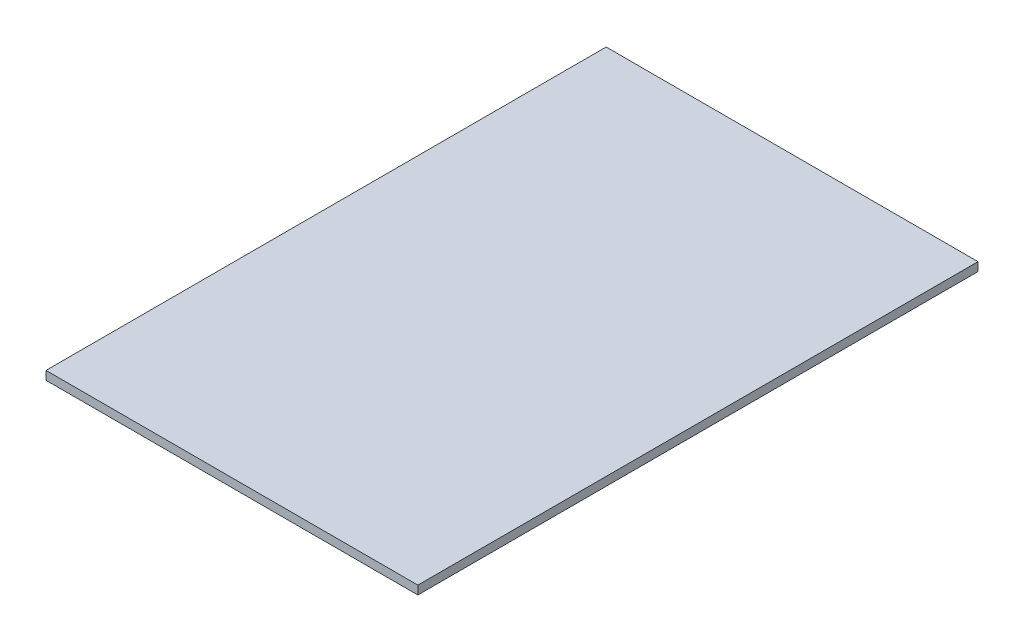
ISO-10303-21;
HEADER;
FILE_DESCRIPTION(('STEP AP214'),'2;1');
FILE_NAME('part.step','',(''),(''),'','','');
FILE_SCHEMA(('AUTOMOTIVE_DESIGN { 1 0 10303 214 1 1 1 1 }'));
ENDSEC;
DATA;
#1=APPLICATION_CONTEXT('core data for automotive mechanical design processes');
#2=APPLICATION_PROTOCOL_DEFINITION('international standard','automotive_design',2000,#1);
#3=PRODUCT_CONTEXT('',#1,'mechanical');
#4=PRODUCT('Part','Part','',(#3));
#5=PRODUCT_RELATED_PRODUCT_CATEGORY('part','',(#4));
#6=PRODUCT_DEFINITION_FORMATION('','',#4);
#7=PRODUCT_DEFINITION_CONTEXT('part definition',#1,'design');
#8=PRODUCT_DEFINITION('design','',#6,#7);
#9=PRODUCT_DEFINITION_SHAPE('','',#8);
#10=(LENGTH_UNIT() NAMED_UNIT(*) SI_UNIT(.MILLI.,.METRE.));
#11=(NAMED_UNIT(*) PLANE_ANGLE_UNIT() SI_UNIT($,.RADIAN.));
#12=(NAMED_UNIT(*) SI_UNIT($,.STERADIAN.) SOLID_ANGLE_UNIT());
#13=UNCERTAINTY_MEASURE_WITH_UNIT(LENGTH_MEASURE(1.E-05),#10,'distance_accuracy_value','');
#14=(GEOMETRIC_REPRESENTATION_CONTEXT(3) GLOBAL_UNCERTAINTY_ASSIGNED_CONTEXT((#13)) GLOBAL_UNIT_ASSIGNED_CONTEXT((#10,
#11,#12)) REPRESENTATION_CONTEXT('',''));
#15=CARTESIAN_POINT('',(0.,0.,0.));
#16=DIRECTION('',(0.,0.,1.));
#17=DIRECTION('',(1.,0.,0.));
#18=AXIS2_PLACEMENT_3D('',#15,#16,#17);
#19=CARTESIAN_POINT('',(0.,0.,0.));
#20=DIRECTION('',(0.,0.,1.));
#21=DIRECTION('',(1.,0.,0.));
#22=AXIS2_PLACEMENT_3D('',#19,#20,#21);
#23=PLANE('',#22);
#24=DIRECTION('',(0.,-1.,0.));
#25=VECTOR('',#24,1.);
#26=CARTESIAN_POINT('',(-305.,17.,0.));
#27=LINE('',#26,#25);
#28=CARTESIAN_POINT('',(-305.,17.,0.));
#29=VERTEX_POINT('',#28);
#30=CARTESIAN_POINT('',(-305.,0.,0.));
#31=VERTEX_POINT('',#30);
#32=EDGE_CURVE('E81',#29,#31,#27,.T.);
#33=ORIENTED_EDGE('',*,*,#32,.T.);
#34=DIRECTION('',(1.,0.,0.));
#35=VECTOR('',#34,1.);
#36=CARTESIAN_POINT('',(-305.,0.,0.));
#37=LINE('',#36,#35);
#38=CARTESIAN_POINT('',(430.999999999999,0.,0.));
#39=VERTEX_POINT('',#38);
#40=EDGE_CURVE('E88',#31,#39,#37,.T.);
#41=ORIENTED_EDGE('',*,*,#40,.T.);
#42=DIRECTION('',(0.,1.,0.));
#43=VECTOR('',#42,1.);
#44=CARTESIAN_POINT('',(430.999999999999,17.,0.));
#45=LINE('',#44,#43);
#46=CARTESIAN_POINT('',(430.999999999999,17.,0.));
#47=VERTEX_POINT('',#46);
#48=EDGE_CURVE('E93',#39,#47,#45,.T.);
#49=ORIENTED_EDGE('',*,*,#48,.T.);
#50=DIRECTION('',(-1.,0.,0.));
#51=VECTOR('',#50,1.);
#52=CARTESIAN_POINT('',(-305.,17.,0.));
#53=LINE('',#52,#51);
#54=EDGE_CURVE('E85',#47,#29,#53,.T.);
#55=ORIENTED_EDGE('',*,*,#54,.T.);
#56=EDGE_LOOP('',(#33,#41,#49,#55));
#57=FACE_BOUND('',#56,.T.);
#58=ADVANCED_FACE('F33',(#57),#23,.T.);
#59=CARTESIAN_POINT('',(-305.,0.,-1844.89630534253));
#60=DIRECTION('',(0.,-1.,0.));
#61=DIRECTION('',(0.,0.,-1.));
#62=AXIS2_PLACEMENT_3D('',#59,#60,#61);
#63=PLANE('',#62);
#64=DIRECTION('',(0.,0.,1.));
#65=VECTOR('',#64,1.);
#66=CARTESIAN_POINT('',(-305.,0.,-1844.89630534253));
#67=LINE('',#66,#65);
#68=CARTESIAN_POINT('',(-305.,0.,-1108.7));
#69=VERTEX_POINT('',#68);
#70=EDGE_CURVE('E78',#69,#31,#67,.T.);
#71=ORIENTED_EDGE('',*,*,#70,.F.);
#72=DIRECTION('',(1.,0.,0.));
#73=VECTOR('',#72,1.);
#74=CARTESIAN_POINT('',(-305.,0.,-1108.7));
#75=LINE('',#74,#73);
#76=CARTESIAN_POINT('',(430.999999999999,0.,-1108.7));
#77=VERTEX_POINT('',#76);
#78=EDGE_CURVE('E51',#69,#77,#75,.T.);
#79=ORIENTED_EDGE('',*,*,#78,.T.);
#80=DIRECTION('',(0.,0.,1.));
#81=VECTOR('',#80,1.);
#82=CARTESIAN_POINT('',(430.999999999999,0.,-1844.89630534253));
#83=LINE('',#82,#81);
#84=EDGE_CURVE('E84',#77,#39,#83,.T.);
#85=ORIENTED_EDGE('',*,*,#84,.T.);
#86=ORIENTED_EDGE('',*,*,#40,.F.);
#87=EDGE_LOOP('',(#71,#79,#85,#86));
#88=FACE_BOUND('',#87,.T.);
#89=ADVANCED_FACE('F89',(#88),#63,.T.);
#90=CARTESIAN_POINT('',(430.999999999999,17.,-1844.89630534253));
#91=DIRECTION('',(1.,0.,0.));
#92=DIRECTION('',(0.,0.,-1.));
#93=AXIS2_PLACEMENT_3D('',#90,#91,#92);
#94=PLANE('',#93);
#95=ORIENTED_EDGE('',*,*,#84,.F.);
#96=DIRECTION('',(0.,1.,0.));
#97=VECTOR('',#96,1.);
#98=CARTESIAN_POINT('',(430.999999999999,17.,-1108.7));
#99=LINE('',#98,#97);
#100=CARTESIAN_POINT('',(431.000000000001,17.,-1108.7));
#101=VERTEX_POINT('',#100);
#102=EDGE_CURVE('E37',#77,#101,#99,.T.);
#103=ORIENTED_EDGE('',*,*,#102,.T.);
#104=DIRECTION('',(0.,0.,1.));
#105=VECTOR('',#104,1.);
#106=CARTESIAN_POINT('',(430.999999999999,17.,-1844.89630534253));
#107=LINE('',#106,#105);
#108=EDGE_CURVE('E101',#101,#47,#107,.T.);
#109=ORIENTED_EDGE('',*,*,#108,.T.);
#110=ORIENTED_EDGE('',*,*,#48,.F.);
#111=EDGE_LOOP('',(#95,#103,#109,#110));
#112=FACE_BOUND('',#111,.T.);
#113=ADVANCED_FACE('F117',(#112),#94,.T.);
#114=CARTESIAN_POINT('',(-305.,17.,-1844.89630534253));
#115=DIRECTION('',(0.,1.,0.));
#116=DIRECTION('',(0.,0.,1.));
#117=AXIS2_PLACEMENT_3D('',#114,#115,#116);
#118=PLANE('',#117);
#119=ORIENTED_EDGE('',*,*,#108,.F.);
#120=DIRECTION('',(-1.,0.,0.));
#121=VECTOR('',#120,1.);
#122=CARTESIAN_POINT('',(-305.,17.,-1108.7));
#123=LINE('',#122,#121);
#124=CARTESIAN_POINT('',(-305.,17.,-1108.7));
#125=VERTEX_POINT('',#124);
#126=EDGE_CURVE('E43',#101,#125,#123,.T.);
#127=ORIENTED_EDGE('',*,*,#126,.T.);
#128=DIRECTION('',(0.,0.,1.));
#129=VECTOR('',#128,1.);
#130=CARTESIAN_POINT('',(-305.,17.,-1844.89630534253));
#131=LINE('',#130,#129);
#132=EDGE_CURVE('E66',#125,#29,#131,.T.);
#133=ORIENTED_EDGE('',*,*,#132,.T.);
#134=ORIENTED_EDGE('',*,*,#54,.F.);
#135=EDGE_LOOP('',(#119,#127,#133,#134));
#136=FACE_BOUND('',#135,.T.);
#137=ADVANCED_FACE('F105',(#136),#118,.T.);
#138=CARTESIAN_POINT('',(-305.,17.,-1844.89630534253));
#139=DIRECTION('',(-1.,0.,0.));
#140=DIRECTION('',(0.,0.,1.));
#141=AXIS2_PLACEMENT_3D('',#138,#139,#140);
#142=PLANE('',#141);
#143=ORIENTED_EDGE('',*,*,#132,.F.);
#144=DIRECTION('',(0.,-1.,0.));
#145=VECTOR('',#144,1.);
#146=CARTESIAN_POINT('',(-305.,17.,-1108.7));
#147=LINE('',#146,#145);
#148=EDGE_CURVE('E11',#125,#69,#147,.T.);
#149=ORIENTED_EDGE('',*,*,#148,.T.);
#150=ORIENTED_EDGE('',*,*,#70,.T.);
#151=ORIENTED_EDGE('',*,*,#32,.F.);
#152=EDGE_LOOP('',(#143,#149,#150,#151));
#153=FACE_BOUND('',#152,.T.);
#154=ADVANCED_FACE('F35',(#153),#142,.T.);
#155=CARTESIAN_POINT('',(431.000000000001,674.135566945079,-1108.7));
#156=DIRECTION('',(0.,0.,-1.));
#157=DIRECTION('',(-1.,0.,0.));
#158=AXIS2_PLACEMENT_3D('',#155,#156,#157);
#159=PLANE('',#158);
#160=ORIENTED_EDGE('',*,*,#126,.F.);
#161=ORIENTED_EDGE('',*,*,#102,.F.);
#162=ORIENTED_EDGE('',*,*,#78,.F.);
#163=ORIENTED_EDGE('',*,*,#148,.F.);
#164=EDGE_LOOP('',(#160,#161,#162,#163));
#165=FACE_BOUND('',#164,.T.);
#166=ADVANCED_FACE('F106',(#165),#159,.T.);
#167=CLOSED_SHELL('',(#58,#89,#113,#137,#154,#166));
#168=MANIFOLD_SOLID_BREP('B2',#167);
#169=ADVANCED_BREP_SHAPE_REPRESENTATION('',(#18,#168),#14);
#170=SHAPE_DEFINITION_REPRESENTATION(#9,#169);
ENDSEC;
END-ISO-10303-21;
